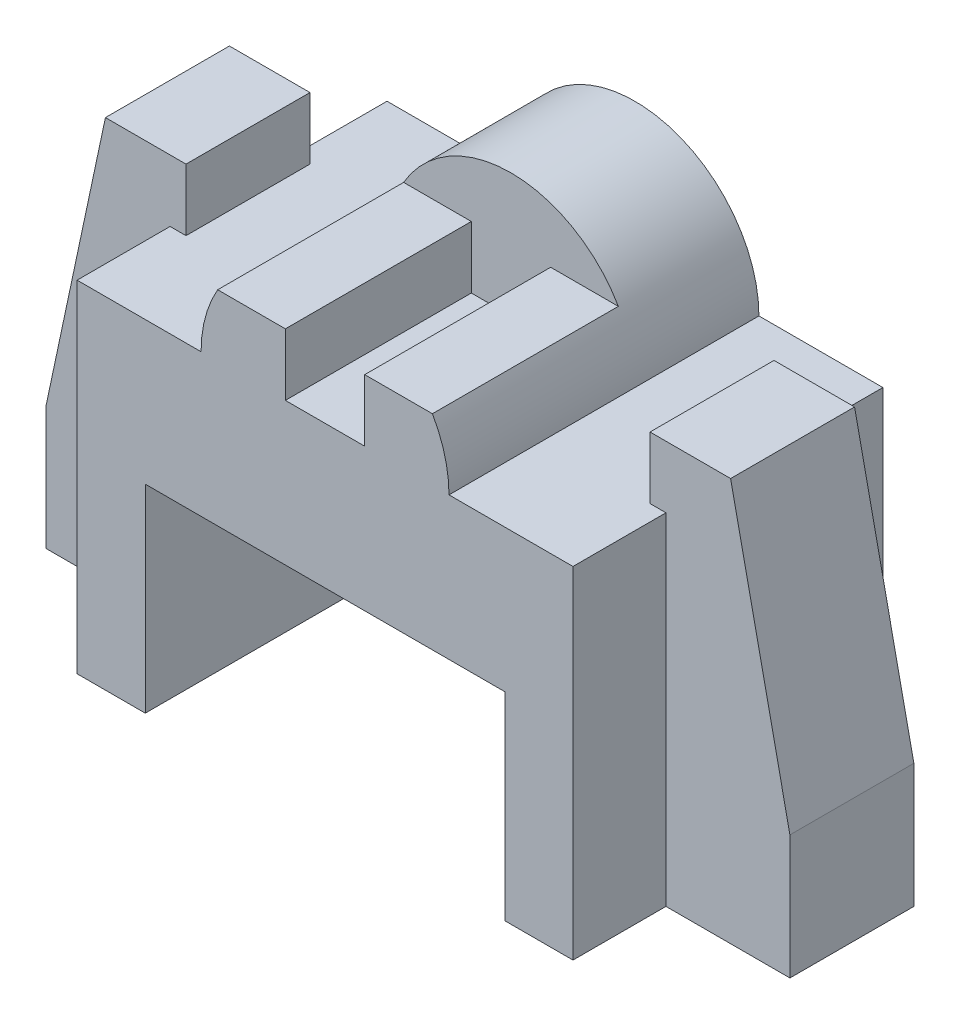
ISO-10303-21;
HEADER;
FILE_DESCRIPTION(('STEP AP214'),'2;1');
FILE_NAME('part.step','',(''),(''),'','','');
FILE_SCHEMA(('AUTOMOTIVE_DESIGN { 1 0 10303 214 1 1 1 1 }'));
ENDSEC;
DATA;
#1=APPLICATION_CONTEXT('core data for automotive mechanical design processes');
#2=APPLICATION_PROTOCOL_DEFINITION('international standard','automotive_design',2000,#1);
#3=PRODUCT_CONTEXT('',#1,'mechanical');
#4=PRODUCT('Part','Part','',(#3));
#5=PRODUCT_RELATED_PRODUCT_CATEGORY('part','',(#4));
#6=PRODUCT_DEFINITION_FORMATION('','',#4);
#7=PRODUCT_DEFINITION_CONTEXT('part definition',#1,'design');
#8=PRODUCT_DEFINITION('design','',#6,#7);
#9=PRODUCT_DEFINITION_SHAPE('','',#8);
#10=(LENGTH_UNIT() NAMED_UNIT(*) SI_UNIT(.MILLI.,.METRE.));
#11=(NAMED_UNIT(*) PLANE_ANGLE_UNIT() SI_UNIT($,.RADIAN.));
#12=(NAMED_UNIT(*) SI_UNIT($,.STERADIAN.) SOLID_ANGLE_UNIT());
#13=UNCERTAINTY_MEASURE_WITH_UNIT(LENGTH_MEASURE(1.E-05),#10,'distance_accuracy_value','');
#14=(GEOMETRIC_REPRESENTATION_CONTEXT(3) GLOBAL_UNCERTAINTY_ASSIGNED_CONTEXT((#13)) GLOBAL_UNIT_ASSIGNED_CONTEXT((#10,
#11,#12)) REPRESENTATION_CONTEXT('',''));
#15=CARTESIAN_POINT('',(0.,0.,0.));
#16=DIRECTION('',(0.,0.,1.));
#17=DIRECTION('',(1.,0.,0.));
#18=AXIS2_PLACEMENT_3D('',#15,#16,#17);
#19=CARTESIAN_POINT('',(0.,55.,-50.));
#20=DIRECTION('',(0.,-1.,0.));
#21=DIRECTION('',(0.,0.,-1.));
#22=AXIS2_PLACEMENT_3D('',#19,#20,#21);
#23=PLANE('',#22);
#24=DIRECTION('',(0.,0.,1.));
#25=VECTOR('',#24,1.);
#26=CARTESIAN_POINT('',(60.,55.,-50.));
#27=LINE('',#26,#25);
#28=CARTESIAN_POINT('',(60.,55.,-50.));
#29=VERTEX_POINT('',#28);
#30=CARTESIAN_POINT('',(60.,55.,0.));
#31=VERTEX_POINT('',#30);
#32=EDGE_CURVE('E53',#29,#31,#27,.T.);
#33=ORIENTED_EDGE('',*,*,#32,.T.);
#34=DIRECTION('',(1.,0.,0.));
#35=VECTOR('',#34,1.);
#36=CARTESIAN_POINT('',(0.,55.,0.));
#37=LINE('',#36,#35);
#38=CARTESIAN_POINT('',(80.,55.,0.));
#39=VERTEX_POINT('',#38);
#40=EDGE_CURVE('E427',#31,#39,#37,.T.);
#41=ORIENTED_EDGE('',*,*,#40,.T.);
#42=DIRECTION('',(0.,0.,1.));
#43=VECTOR('',#42,1.);
#44=CARTESIAN_POINT('',(80.,55.,-15.));
#45=LINE('',#44,#43);
#46=CARTESIAN_POINT('',(80.,55.,-15.));
#47=VERTEX_POINT('',#46);
#48=EDGE_CURVE('E430',#47,#39,#45,.T.);
#49=ORIENTED_EDGE('',*,*,#48,.F.);
#50=DIRECTION('',(1.,0.,0.));
#51=VECTOR('',#50,1.);
#52=CARTESIAN_POINT('',(77.43,55.,-15.));
#53=LINE('',#52,#51);
#54=CARTESIAN_POINT('',(77.43,55.,-15.));
#55=VERTEX_POINT('',#54);
#56=EDGE_CURVE('E446',#55,#47,#53,.T.);
#57=ORIENTED_EDGE('',*,*,#56,.F.);
#58=DIRECTION('',(0.,0.,-1.));
#59=VECTOR('',#58,1.);
#60=CARTESIAN_POINT('',(77.43,55.,1.2E-05));
#61=LINE('',#60,#59);
#62=CARTESIAN_POINT('',(77.43,55.,-35.));
#63=VERTEX_POINT('',#62);
#64=EDGE_CURVE('E40',#55,#63,#61,.T.);
#65=ORIENTED_EDGE('',*,*,#64,.T.);
#66=DIRECTION('',(1.,0.,0.));
#67=VECTOR('',#66,1.);
#68=CARTESIAN_POINT('',(80.,55.,-35.));
#69=LINE('',#68,#67);
#70=CARTESIAN_POINT('',(80.,55.,-35.));
#71=VERTEX_POINT('',#70);
#72=EDGE_CURVE('E324',#63,#71,#69,.T.);
#73=ORIENTED_EDGE('',*,*,#72,.T.);
#74=DIRECTION('',(0.,0.,1.));
#75=VECTOR('',#74,1.);
#76=CARTESIAN_POINT('',(80.,55.,-50.));
#77=LINE('',#76,#75);
#78=CARTESIAN_POINT('',(80.,55.,-50.));
#79=VERTEX_POINT('',#78);
#80=EDGE_CURVE('E315',#79,#71,#77,.T.);
#81=ORIENTED_EDGE('',*,*,#80,.F.);
#82=DIRECTION('',(1.,0.,0.));
#83=VECTOR('',#82,1.);
#84=CARTESIAN_POINT('',(0.,55.,-50.));
#85=LINE('',#84,#83);
#86=EDGE_CURVE('E357',#29,#79,#85,.T.);
#87=ORIENTED_EDGE('',*,*,#86,.F.);
#88=EDGE_LOOP('',(#33,#41,#49,#57,#65,#73,#81,#87));
#89=FACE_BOUND('',#88,.T.);
#90=ADVANCED_FACE('F36',(#89),#23,.F.);
#91=CARTESIAN_POINT('',(0.,55.,0.));
#92=VERTEX_POINT('',#91);
#93=CARTESIAN_POINT('',(20.,55.,0.));
#94=VERTEX_POINT('',#93);
#95=EDGE_CURVE('E319',#92,#94,#37,.T.);
#96=ORIENTED_EDGE('',*,*,#95,.T.);
#97=DIRECTION('',(0.,0.,1.));
#98=VECTOR('',#97,1.);
#99=CARTESIAN_POINT('',(20.,55.,-50.));
#100=LINE('',#99,#98);
#101=CARTESIAN_POINT('',(20.,55.,-50.));
#102=VERTEX_POINT('',#101);
#103=EDGE_CURVE('E295',#94,#102,#100,.F.);
#104=ORIENTED_EDGE('',*,*,#103,.T.);
#105=CARTESIAN_POINT('',(0.,55.,-50.));
#106=VERTEX_POINT('',#105);
#107=EDGE_CURVE('E352',#106,#102,#85,.T.);
#108=ORIENTED_EDGE('',*,*,#107,.F.);
#109=DIRECTION('',(0.,0.,1.));
#110=VECTOR('',#109,1.);
#111=CARTESIAN_POINT('',(0.,55.,-50.));
#112=LINE('',#111,#110);
#113=CARTESIAN_POINT('',(0.,55.,-35.));
#114=VERTEX_POINT('',#113);
#115=EDGE_CURVE('E320',#106,#114,#112,.T.);
#116=ORIENTED_EDGE('',*,*,#115,.T.);
#117=DIRECTION('',(1.,0.,0.));
#118=VECTOR('',#117,1.);
#119=CARTESIAN_POINT('',(0.,55.,-35.));
#120=LINE('',#119,#118);
#121=CARTESIAN_POINT('',(2.57,55.,-35.));
#122=VERTEX_POINT('',#121);
#123=EDGE_CURVE('E323',#114,#122,#120,.T.);
#124=ORIENTED_EDGE('',*,*,#123,.T.);
#125=DIRECTION('',(0.,0.,-1.));
#126=VECTOR('',#125,1.);
#127=CARTESIAN_POINT('',(2.57,55.,1.2E-05));
#128=LINE('',#127,#126);
#129=CARTESIAN_POINT('',(2.57,55.,-14.999988));
#130=VERTEX_POINT('',#129);
#131=EDGE_CURVE('E298',#130,#122,#128,.T.);
#132=ORIENTED_EDGE('',*,*,#131,.F.);
#133=DIRECTION('',(1.,0.,0.));
#134=VECTOR('',#133,1.);
#135=CARTESIAN_POINT('',(0.,55.,-14.999988));
#136=LINE('',#135,#134);
#137=CARTESIAN_POINT('',(0.,55.,-14.999988));
#138=VERTEX_POINT('',#137);
#139=EDGE_CURVE('E437',#138,#130,#136,.T.);
#140=ORIENTED_EDGE('',*,*,#139,.F.);
#141=DIRECTION('',(0.,0.,1.));
#142=VECTOR('',#141,1.);
#143=CARTESIAN_POINT('',(0.,55.,-14.999988));
#144=LINE('',#143,#142);
#145=EDGE_CURVE('E399',#138,#92,#144,.T.);
#146=ORIENTED_EDGE('',*,*,#145,.T.);
#147=EDGE_LOOP('',(#96,#104,#108,#116,#124,#132,#140,#146));
#148=FACE_BOUND('',#147,.T.);
#149=ADVANCED_FACE('F553',(#148),#23,.F.);
#150=CARTESIAN_POINT('',(40.,55.,-50.));
#151=DIRECTION('',(0.,0.,1.));
#152=DIRECTION('',(1.,0.,0.));
#153=AXIS2_PLACEMENT_3D('',#150,#151,#152);
#154=CYLINDRICAL_SURFACE('',#153,20.);
#155=ORIENTED_EDGE('',*,*,#103,.F.);
#156=CARTESIAN_POINT('',(40.,55.,0.));
#157=DIRECTION('',(0.,0.,1.));
#158=DIRECTION('',(1.,0.,0.));
#159=AXIS2_PLACEMENT_3D('',#156,#157,#158);
#160=CIRCLE('',#159,20.);
#161=CARTESIAN_POINT('',(22.6794919243112,65.,0.));
#162=VERTEX_POINT('',#161);
#163=EDGE_CURVE('E266',#162,#94,#160,.T.);
#164=ORIENTED_EDGE('',*,*,#163,.F.);
#165=DIRECTION('',(0.,0.,1.));
#166=VECTOR('',#165,1.);
#167=CARTESIAN_POINT('',(22.6794919243112,65.,-30.));
#168=LINE('',#167,#166);
#169=CARTESIAN_POINT('',(22.6794919243112,65.,-30.));
#170=VERTEX_POINT('',#169);
#171=EDGE_CURVE('E284',#170,#162,#168,.T.);
#172=ORIENTED_EDGE('',*,*,#171,.F.);
#173=CARTESIAN_POINT('',(40.,55.,-30.));
#174=DIRECTION('',(0.,0.,1.));
#175=DIRECTION('',(1.,0.,0.));
#176=AXIS2_PLACEMENT_3D('',#173,#174,#175);
#177=CIRCLE('',#176,20.);
#178=CARTESIAN_POINT('',(57.3205080756888,65.,-30.));
#179=VERTEX_POINT('',#178);
#180=EDGE_CURVE('E286',#179,#170,#177,.T.);
#181=ORIENTED_EDGE('',*,*,#180,.F.);
#182=DIRECTION('',(0.,0.,1.));
#183=VECTOR('',#182,1.);
#184=CARTESIAN_POINT('',(57.3205080756888,65.,-30.));
#185=LINE('',#184,#183);
#186=CARTESIAN_POINT('',(57.3205080756888,65.,0.));
#187=VERTEX_POINT('',#186);
#188=EDGE_CURVE('E244',#179,#187,#185,.T.);
#189=ORIENTED_EDGE('',*,*,#188,.T.);
#190=CARTESIAN_POINT('',(40.,55.,0.));
#191=DIRECTION('',(0.,0.,1.));
#192=DIRECTION('',(1.,0.,0.));
#193=AXIS2_PLACEMENT_3D('',#190,#191,#192);
#194=CIRCLE('',#193,20.);
#195=EDGE_CURVE('E262',#31,#187,#194,.T.);
#196=ORIENTED_EDGE('',*,*,#195,.F.);
#197=ORIENTED_EDGE('',*,*,#32,.F.);
#198=CARTESIAN_POINT('',(40.,55.,-50.));
#199=DIRECTION('',(0.,0.,1.));
#200=DIRECTION('',(1.,0.,0.));
#201=AXIS2_PLACEMENT_3D('',#198,#199,#200);
#202=CIRCLE('',#201,20.);
#203=EDGE_CURVE('E292',#29,#102,#202,.T.);
#204=ORIENTED_EDGE('',*,*,#203,.T.);
#205=EDGE_LOOP('',(#155,#164,#172,#181,#189,#196,#197,#204));
#206=FACE_BOUND('',#205,.T.);
#207=ADVANCED_FACE('F535',(#206),#154,.T.);
#208=CARTESIAN_POINT('',(2.57,55.,1.2E-05));
#209=DIRECTION('',(-1.,0.,0.));
#210=DIRECTION('',(0.,0.,1.));
#211=AXIS2_PLACEMENT_3D('',#208,#209,#210);
#212=PLANE('',#211);
#213=DIRECTION('',(0.,1.,0.));
#214=VECTOR('',#213,1.);
#215=CARTESIAN_POINT('',(2.57,55.,-14.999988));
#216=LINE('',#215,#214);
#217=CARTESIAN_POINT('',(2.57,65.,-14.999988));
#218=VERTEX_POINT('',#217);
#219=EDGE_CURVE('E435',#130,#218,#216,.T.);
#220=ORIENTED_EDGE('',*,*,#219,.F.);
#221=ORIENTED_EDGE('',*,*,#131,.T.);
#222=DIRECTION('',(0.,1.,0.));
#223=VECTOR('',#222,1.);
#224=CARTESIAN_POINT('',(2.57,55.,-35.));
#225=LINE('',#224,#223);
#226=CARTESIAN_POINT('',(2.57,65.,-35.));
#227=VERTEX_POINT('',#226);
#228=EDGE_CURVE('E380',#122,#227,#225,.T.);
#229=ORIENTED_EDGE('',*,*,#228,.T.);
#230=DIRECTION('',(0.,0.,-1.));
#231=VECTOR('',#230,1.);
#232=CARTESIAN_POINT('',(2.57,65.,1.2E-05));
#233=LINE('',#232,#231);
#234=EDGE_CURVE('E381',#218,#227,#233,.T.);
#235=ORIENTED_EDGE('',*,*,#234,.F.);
#236=EDGE_LOOP('',(#220,#221,#229,#235));
#237=FACE_BOUND('',#236,.T.);
#238=ADVANCED_FACE('F568',(#237),#212,.F.);
#239=CARTESIAN_POINT('',(2.57,65.,1.2E-05));
#240=DIRECTION('',(0.,-1.,0.));
#241=DIRECTION('',(0.,0.,-1.));
#242=AXIS2_PLACEMENT_3D('',#239,#240,#241);
#243=PLANE('',#242);
#244=DIRECTION('',(-1.,0.,0.));
#245=VECTOR('',#244,1.);
#246=CARTESIAN_POINT('',(2.57,65.,-14.999988));
#247=LINE('',#246,#245);
#248=CARTESIAN_POINT('',(-10.43,65.,-14.999988));
#249=VERTEX_POINT('',#248);
#250=EDGE_CURVE('E433',#218,#249,#247,.T.);
#251=ORIENTED_EDGE('',*,*,#250,.F.);
#252=ORIENTED_EDGE('',*,*,#234,.T.);
#253=DIRECTION('',(-1.,0.,0.));
#254=VECTOR('',#253,1.);
#255=CARTESIAN_POINT('',(2.57,65.,-35.));
#256=LINE('',#255,#254);
#257=CARTESIAN_POINT('',(-10.43,65.,-35.));
#258=VERTEX_POINT('',#257);
#259=EDGE_CURVE('E383',#227,#258,#256,.T.);
#260=ORIENTED_EDGE('',*,*,#259,.T.);
#261=DIRECTION('',(0.,0.,-1.));
#262=VECTOR('',#261,1.);
#263=CARTESIAN_POINT('',(-10.43,65.,1.2E-05));
#264=LINE('',#263,#262);
#265=EDGE_CURVE('E384',#249,#258,#264,.T.);
#266=ORIENTED_EDGE('',*,*,#265,.F.);
#267=EDGE_LOOP('',(#251,#252,#260,#266));
#268=FACE_BOUND('',#267,.T.);
#269=ADVANCED_FACE('F593',(#268),#243,.F.);
#270=CARTESIAN_POINT('',(-10.43,65.,1.2E-05));
#271=DIRECTION('',(0.978125693244708,-0.208014730763375,0.));
#272=DIRECTION('',(0.208014730763375,0.978125693244708,0.));
#273=AXIS2_PLACEMENT_3D('',#270,#271,#272);
#274=PLANE('',#273);
#275=DIRECTION('',(-0.208014730763375,-0.978125693244708,0.));
#276=VECTOR('',#275,1.);
#277=CARTESIAN_POINT('',(-10.43,65.,-14.999988));
#278=LINE('',#277,#276);
#279=CARTESIAN_POINT('',(-20.,20.,-14.999988));
#280=VERTEX_POINT('',#279);
#281=EDGE_CURVE('E431',#249,#280,#278,.T.);
#282=ORIENTED_EDGE('',*,*,#281,.F.);
#283=ORIENTED_EDGE('',*,*,#265,.T.);
#284=DIRECTION('',(-0.208014730763375,-0.978125693244708,0.));
#285=VECTOR('',#284,1.);
#286=CARTESIAN_POINT('',(-10.43,65.,-35.));
#287=LINE('',#286,#285);
#288=CARTESIAN_POINT('',(-20.,20.,-35.));
#289=VERTEX_POINT('',#288);
#290=EDGE_CURVE('E378',#258,#289,#287,.T.);
#291=ORIENTED_EDGE('',*,*,#290,.T.);
#292=DIRECTION('',(0.,0.,1.));
#293=VECTOR('',#292,1.);
#294=CARTESIAN_POINT('',(-20.,20.,-35.));
#295=LINE('',#294,#293);
#296=EDGE_CURVE('E374',#289,#280,#295,.T.);
#297=ORIENTED_EDGE('',*,*,#296,.T.);
#298=EDGE_LOOP('',(#282,#283,#291,#297));
#299=FACE_BOUND('',#298,.T.);
#300=ADVANCED_FACE('F559',(#299),#274,.F.);
#301=CARTESIAN_POINT('',(-20.,0.,1.2E-05));
#302=DIRECTION('',(1.,0.,0.));
#303=DIRECTION('',(0.,0.,-1.));
#304=AXIS2_PLACEMENT_3D('',#301,#302,#303);
#305=PLANE('',#304);
#306=DIRECTION('',(0.,-1.,0.));
#307=VECTOR('',#306,1.);
#308=CARTESIAN_POINT('',(-20.,20.,-14.999988));
#309=LINE('',#308,#307);
#310=CARTESIAN_POINT('',(-20.,0.,-14.999988));
#311=VERTEX_POINT('',#310);
#312=EDGE_CURVE('E428',#280,#311,#309,.T.);
#313=ORIENTED_EDGE('',*,*,#312,.F.);
#314=ORIENTED_EDGE('',*,*,#296,.F.);
#315=DIRECTION('',(0.,-1.,0.));
#316=VECTOR('',#315,1.);
#317=CARTESIAN_POINT('',(-20.,0.,-35.));
#318=LINE('',#317,#316);
#319=CARTESIAN_POINT('',(-20.,0.,-35.));
#320=VERTEX_POINT('',#319);
#321=EDGE_CURVE('E377',#289,#320,#318,.T.);
#322=ORIENTED_EDGE('',*,*,#321,.T.);
#323=DIRECTION('',(0.,0.,-1.));
#324=VECTOR('',#323,1.);
#325=CARTESIAN_POINT('',(-20.,0.,1.2E-05));
#326=LINE('',#325,#324);
#327=EDGE_CURVE('E301',#311,#320,#326,.T.);
#328=ORIENTED_EDGE('',*,*,#327,.F.);
#329=EDGE_LOOP('',(#313,#314,#322,#328));
#330=FACE_BOUND('',#329,.T.);
#331=ADVANCED_FACE('F551',(#330),#305,.F.);
#332=CARTESIAN_POINT('',(33.6,55.,0.));
#333=VERTEX_POINT('',#332);
#334=CARTESIAN_POINT('',(46.4,55.,0.));
#335=VERTEX_POINT('',#334);
#336=EDGE_CURVE('E61',#333,#335,#37,.T.);
#337=ORIENTED_EDGE('',*,*,#336,.T.);
#338=DIRECTION('',(0.,0.,1.));
#339=VECTOR('',#338,1.);
#340=CARTESIAN_POINT('',(46.4,55.,-30.));
#341=LINE('',#340,#339);
#342=CARTESIAN_POINT('',(46.4,55.,-30.));
#343=VERTEX_POINT('',#342);
#344=EDGE_CURVE('E254',#343,#335,#341,.T.);
#345=ORIENTED_EDGE('',*,*,#344,.F.);
#346=DIRECTION('',(1.,0.,0.));
#347=VECTOR('',#346,1.);
#348=CARTESIAN_POINT('',(20.,55.,-30.));
#349=LINE('',#348,#347);
#350=CARTESIAN_POINT('',(33.6,55.,-30.));
#351=VERTEX_POINT('',#350);
#352=EDGE_CURVE('E242',#351,#343,#349,.T.);
#353=ORIENTED_EDGE('',*,*,#352,.F.);
#354=DIRECTION('',(0.,0.,1.));
#355=VECTOR('',#354,1.);
#356=CARTESIAN_POINT('',(33.6,55.,-30.));
#357=LINE('',#356,#355);
#358=EDGE_CURVE('E276',#351,#333,#357,.T.);
#359=ORIENTED_EDGE('',*,*,#358,.T.);
#360=EDGE_LOOP('',(#337,#345,#353,#359));
#361=FACE_BOUND('',#360,.T.);
#362=ADVANCED_FACE('F549',(#361),#23,.F.);
#363=CARTESIAN_POINT('',(80.,0.,-50.));
#364=DIRECTION('',(1.,0.,0.));
#365=DIRECTION('',(0.,0.,-1.));
#366=AXIS2_PLACEMENT_3D('',#363,#364,#365);
#367=PLANE('',#366);
#368=ORIENTED_EDGE('',*,*,#80,.T.);
#369=DIRECTION('',(0.,-1.,0.));
#370=VECTOR('',#369,1.);
#371=CARTESIAN_POINT('',(80.,0.,-35.));
#372=LINE('',#371,#370);
#373=CARTESIAN_POINT('',(80.,0.,-35.));
#374=VERTEX_POINT('',#373);
#375=EDGE_CURVE('E318',#71,#374,#372,.T.);
#376=ORIENTED_EDGE('',*,*,#375,.T.);
#377=DIRECTION('',(0.,0.,1.));
#378=VECTOR('',#377,1.);
#379=CARTESIAN_POINT('',(80.,0.,-50.));
#380=LINE('',#379,#378);
#381=CARTESIAN_POINT('',(80.,0.,-50.));
#382=VERTEX_POINT('',#381);
#383=EDGE_CURVE('E310',#382,#374,#380,.T.);
#384=ORIENTED_EDGE('',*,*,#383,.F.);
#385=DIRECTION('',(0.,1.,0.));
#386=VECTOR('',#385,1.);
#387=CARTESIAN_POINT('',(80.,0.,-50.));
#388=LINE('',#387,#386);
#389=EDGE_CURVE('E360',#382,#79,#388,.T.);
#390=ORIENTED_EDGE('',*,*,#389,.T.);
#391=EDGE_LOOP('',(#368,#376,#384,#390));
#392=FACE_BOUND('',#391,.T.);
#393=ADVANCED_FACE('F494',(#392),#367,.T.);
#394=CARTESIAN_POINT('',(11.,0.,-50.));
#395=DIRECTION('',(1.,0.,0.));
#396=DIRECTION('',(0.,0.,-1.));
#397=AXIS2_PLACEMENT_3D('',#394,#395,#396);
#398=PLANE('',#397);
#399=DIRECTION('',(0.,1.,0.));
#400=VECTOR('',#399,1.);
#401=CARTESIAN_POINT('',(11.,0.,0.));
#402=LINE('',#401,#400);
#403=CARTESIAN_POINT('',(11.,0.,0.));
#404=VERTEX_POINT('',#403);
#405=CARTESIAN_POINT('',(11.,32.,0.));
#406=VERTEX_POINT('',#405);
#407=EDGE_CURVE('E349',#404,#406,#402,.T.);
#408=ORIENTED_EDGE('',*,*,#407,.F.);
#409=DIRECTION('',(0.,0.,1.));
#410=VECTOR('',#409,1.);
#411=CARTESIAN_POINT('',(11.,0.,-50.));
#412=LINE('',#411,#410);
#413=CARTESIAN_POINT('',(11.,0.,-50.));
#414=VERTEX_POINT('',#413);
#415=EDGE_CURVE('E328',#414,#404,#412,.T.);
#416=ORIENTED_EDGE('',*,*,#415,.F.);
#417=DIRECTION('',(0.,1.,0.));
#418=VECTOR('',#417,1.);
#419=CARTESIAN_POINT('',(11.,0.,-50.));
#420=LINE('',#419,#418);
#421=CARTESIAN_POINT('',(11.,32.,-50.));
#422=VERTEX_POINT('',#421);
#423=EDGE_CURVE('E302',#414,#422,#420,.T.);
#424=ORIENTED_EDGE('',*,*,#423,.T.);
#425=DIRECTION('',(0.,0.,1.));
#426=VECTOR('',#425,1.);
#427=CARTESIAN_POINT('',(11.,32.,-50.));
#428=LINE('',#427,#426);
#429=EDGE_CURVE('E299',#422,#406,#428,.T.);
#430=ORIENTED_EDGE('',*,*,#429,.T.);
#431=EDGE_LOOP('',(#408,#416,#424,#430));
#432=FACE_BOUND('',#431,.T.);
#433=ADVANCED_FACE('F519',(#432),#398,.T.);
#434=CARTESIAN_POINT('',(0.,0.,-50.));
#435=DIRECTION('',(0.,-1.,0.));
#436=DIRECTION('',(0.,0.,-1.));
#437=AXIS2_PLACEMENT_3D('',#434,#435,#436);
#438=PLANE('',#437);
#439=DIRECTION('',(0.,0.,1.));
#440=VECTOR('',#439,1.);
#441=CARTESIAN_POINT('',(0.,0.,-14.999988));
#442=LINE('',#441,#440);
#443=CARTESIAN_POINT('',(0.,0.,-14.999988));
#444=VERTEX_POINT('',#443);
#445=CARTESIAN_POINT('',(0.,0.,0.));
#446=VERTEX_POINT('',#445);
#447=EDGE_CURVE('E339',#444,#446,#442,.T.);
#448=ORIENTED_EDGE('',*,*,#447,.F.);
#449=DIRECTION('',(1.,0.,0.));
#450=VECTOR('',#449,1.);
#451=CARTESIAN_POINT('',(-20.,0.,-14.999988));
#452=LINE('',#451,#450);
#453=EDGE_CURVE('E338',#311,#444,#452,.T.);
#454=ORIENTED_EDGE('',*,*,#453,.F.);
#455=ORIENTED_EDGE('',*,*,#327,.T.);
#456=DIRECTION('',(1.,0.,0.));
#457=VECTOR('',#456,1.);
#458=CARTESIAN_POINT('',(0.,0.,-35.));
#459=LINE('',#458,#457);
#460=CARTESIAN_POINT('',(0.,0.,-35.));
#461=VERTEX_POINT('',#460);
#462=EDGE_CURVE('E355',#320,#461,#459,.T.);
#463=ORIENTED_EDGE('',*,*,#462,.T.);
#464=DIRECTION('',(0.,0.,1.));
#465=VECTOR('',#464,1.);
#466=CARTESIAN_POINT('',(0.,0.,-50.));
#467=LINE('',#466,#465);
#468=CARTESIAN_POINT('',(0.,0.,-50.));
#469=VERTEX_POINT('',#468);
#470=EDGE_CURVE('E325',#469,#461,#467,.T.);
#471=ORIENTED_EDGE('',*,*,#470,.F.);
#472=DIRECTION('',(1.,0.,0.));
#473=VECTOR('',#472,1.);
#474=CARTESIAN_POINT('',(0.,0.,-50.));
#475=LINE('',#474,#473);
#476=EDGE_CURVE('E330',#469,#414,#475,.T.);
#477=ORIENTED_EDGE('',*,*,#476,.T.);
#478=ORIENTED_EDGE('',*,*,#415,.T.);
#479=DIRECTION('',(1.,0.,0.));
#480=VECTOR('',#479,1.);
#481=CARTESIAN_POINT('',(0.,0.,0.));
#482=LINE('',#481,#480);
#483=EDGE_CURVE('E331',#446,#404,#482,.T.);
#484=ORIENTED_EDGE('',*,*,#483,.F.);
#485=EDGE_LOOP('',(#448,#454,#455,#463,#471,#477,#478,#484));
#486=FACE_BOUND('',#485,.T.);
#487=ADVANCED_FACE('F523',(#486),#438,.T.);
#488=CARTESIAN_POINT('',(0.,0.,-50.));
#489=DIRECTION('',(1.,0.,0.));
#490=DIRECTION('',(0.,0.,-1.));
#491=AXIS2_PLACEMENT_3D('',#488,#489,#490);
#492=PLANE('',#491);
#493=ORIENTED_EDGE('',*,*,#470,.T.);
#494=DIRECTION('',(0.,1.,0.));
#495=VECTOR('',#494,1.);
#496=CARTESIAN_POINT('',(0.,0.,-35.));
#497=LINE('',#496,#495);
#498=EDGE_CURVE('E327',#461,#114,#497,.T.);
#499=ORIENTED_EDGE('',*,*,#498,.T.);
#500=ORIENTED_EDGE('',*,*,#115,.F.);
#501=DIRECTION('',(0.,1.,0.));
#502=VECTOR('',#501,1.);
#503=CARTESIAN_POINT('',(0.,0.,-50.));
#504=LINE('',#503,#502);
#505=EDGE_CURVE('E305',#469,#106,#504,.T.);
#506=ORIENTED_EDGE('',*,*,#505,.F.);
#507=EDGE_LOOP('',(#493,#499,#500,#506));
#508=FACE_BOUND('',#507,.T.);
#509=ADVANCED_FACE('F530',(#508),#492,.F.);
#510=CARTESIAN_POINT('',(69.,0.,-50.));
#511=DIRECTION('',(0.,-1.,0.));
#512=DIRECTION('',(0.,0.,-1.));
#513=AXIS2_PLACEMENT_3D('',#510,#511,#512);
#514=PLANE('',#513);
#515=DIRECTION('',(1.,0.,0.));
#516=VECTOR('',#515,1.);
#517=CARTESIAN_POINT('',(80.,0.,-15.));
#518=LINE('',#517,#516);
#519=CARTESIAN_POINT('',(80.,0.,-15.));
#520=VERTEX_POINT('',#519);
#521=CARTESIAN_POINT('',(100.,0.,-15.));
#522=VERTEX_POINT('',#521);
#523=EDGE_CURVE('E454',#520,#522,#518,.T.);
#524=ORIENTED_EDGE('',*,*,#523,.F.);
#525=DIRECTION('',(0.,0.,1.));
#526=VECTOR('',#525,1.);
#527=CARTESIAN_POINT('',(80.,0.,-15.));
#528=LINE('',#527,#526);
#529=CARTESIAN_POINT('',(80.,0.,0.));
#530=VERTEX_POINT('',#529);
#531=EDGE_CURVE('E365',#520,#530,#528,.T.);
#532=ORIENTED_EDGE('',*,*,#531,.T.);
#533=DIRECTION('',(1.,0.,0.));
#534=VECTOR('',#533,1.);
#535=CARTESIAN_POINT('',(69.,0.,0.));
#536=LINE('',#535,#534);
#537=CARTESIAN_POINT('',(69.,0.,0.));
#538=VERTEX_POINT('',#537);
#539=EDGE_CURVE('E340',#538,#530,#536,.T.);
#540=ORIENTED_EDGE('',*,*,#539,.F.);
#541=DIRECTION('',(0.,0.,1.));
#542=VECTOR('',#541,1.);
#543=CARTESIAN_POINT('',(69.,0.,-50.));
#544=LINE('',#543,#542);
#545=CARTESIAN_POINT('',(69.,0.,-50.));
#546=VERTEX_POINT('',#545);
#547=EDGE_CURVE('E307',#546,#538,#544,.T.);
#548=ORIENTED_EDGE('',*,*,#547,.F.);
#549=DIRECTION('',(1.,0.,0.));
#550=VECTOR('',#549,1.);
#551=CARTESIAN_POINT('',(69.,0.,-50.));
#552=LINE('',#551,#550);
#553=EDGE_CURVE('E314',#546,#382,#552,.T.);
#554=ORIENTED_EDGE('',*,*,#553,.T.);
#555=ORIENTED_EDGE('',*,*,#383,.T.);
#556=DIRECTION('',(1.,0.,0.));
#557=VECTOR('',#556,1.);
#558=CARTESIAN_POINT('',(80.,0.,-35.));
#559=LINE('',#558,#557);
#560=CARTESIAN_POINT('',(100.,0.,-35.));
#561=VERTEX_POINT('',#560);
#562=EDGE_CURVE('E313',#374,#561,#559,.T.);
#563=ORIENTED_EDGE('',*,*,#562,.T.);
#564=DIRECTION('',(0.,0.,-1.));
#565=VECTOR('',#564,1.);
#566=CARTESIAN_POINT('',(100.,0.,1.2E-05));
#567=LINE('',#566,#565);
#568=EDGE_CURVE('E405',#522,#561,#567,.T.);
#569=ORIENTED_EDGE('',*,*,#568,.F.);
#570=EDGE_LOOP('',(#524,#532,#540,#548,#554,#555,#563,#569));
#571=FACE_BOUND('',#570,.T.);
#572=ADVANCED_FACE('F38',(#571),#514,.T.);
#573=CARTESIAN_POINT('',(69.,32.,-50.));
#574=DIRECTION('',(-1.,0.,0.));
#575=DIRECTION('',(0.,0.,1.));
#576=AXIS2_PLACEMENT_3D('',#573,#574,#575);
#577=PLANE('',#576);
#578=DIRECTION('',(0.,-1.,0.));
#579=VECTOR('',#578,1.);
#580=CARTESIAN_POINT('',(69.,32.,0.));
#581=LINE('',#580,#579);
#582=CARTESIAN_POINT('',(69.,32.,0.));
#583=VERTEX_POINT('',#582);
#584=EDGE_CURVE('E343',#583,#538,#581,.T.);
#585=ORIENTED_EDGE('',*,*,#584,.F.);
#586=DIRECTION('',(0.,0.,1.));
#587=VECTOR('',#586,1.);
#588=CARTESIAN_POINT('',(69.,32.,-50.));
#589=LINE('',#588,#587);
#590=CARTESIAN_POINT('',(69.,32.,-50.));
#591=VERTEX_POINT('',#590);
#592=EDGE_CURVE('E303',#591,#583,#589,.T.);
#593=ORIENTED_EDGE('',*,*,#592,.F.);
#594=DIRECTION('',(0.,-1.,0.));
#595=VECTOR('',#594,1.);
#596=CARTESIAN_POINT('',(69.,32.,-50.));
#597=LINE('',#596,#595);
#598=EDGE_CURVE('E309',#591,#546,#597,.T.);
#599=ORIENTED_EDGE('',*,*,#598,.T.);
#600=ORIENTED_EDGE('',*,*,#547,.T.);
#601=EDGE_LOOP('',(#585,#593,#599,#600));
#602=FACE_BOUND('',#601,.T.);
#603=ADVANCED_FACE('F509',(#602),#577,.T.);
#604=CARTESIAN_POINT('',(11.,32.,-50.));
#605=DIRECTION('',(0.,-1.,0.));
#606=DIRECTION('',(0.,0.,-1.));
#607=AXIS2_PLACEMENT_3D('',#604,#605,#606);
#608=PLANE('',#607);
#609=DIRECTION('',(1.,0.,0.));
#610=VECTOR('',#609,1.);
#611=CARTESIAN_POINT('',(11.,32.,0.));
#612=LINE('',#611,#610);
#613=EDGE_CURVE('E346',#406,#583,#612,.T.);
#614=ORIENTED_EDGE('',*,*,#613,.F.);
#615=ORIENTED_EDGE('',*,*,#429,.F.);
#616=DIRECTION('',(1.,0.,0.));
#617=VECTOR('',#616,1.);
#618=CARTESIAN_POINT('',(11.,32.,-50.));
#619=LINE('',#618,#617);
#620=EDGE_CURVE('E306',#422,#591,#619,.T.);
#621=ORIENTED_EDGE('',*,*,#620,.T.);
#622=ORIENTED_EDGE('',*,*,#592,.T.);
#623=EDGE_LOOP('',(#614,#615,#621,#622));
#624=FACE_BOUND('',#623,.T.);
#625=ADVANCED_FACE('F516',(#624),#608,.T.);
#626=CARTESIAN_POINT('',(0.,0.,-50.));
#627=DIRECTION('',(0.,0.,-1.));
#628=DIRECTION('',(-1.,0.,0.));
#629=AXIS2_PLACEMENT_3D('',#626,#627,#628);
#630=PLANE('',#629);
#631=ORIENTED_EDGE('',*,*,#107,.T.);
#632=ORIENTED_EDGE('',*,*,#203,.F.);
#633=ORIENTED_EDGE('',*,*,#86,.T.);
#634=ORIENTED_EDGE('',*,*,#389,.F.);
#635=ORIENTED_EDGE('',*,*,#553,.F.);
#636=ORIENTED_EDGE('',*,*,#598,.F.);
#637=ORIENTED_EDGE('',*,*,#620,.F.);
#638=ORIENTED_EDGE('',*,*,#423,.F.);
#639=ORIENTED_EDGE('',*,*,#476,.F.);
#640=ORIENTED_EDGE('',*,*,#505,.T.);
#641=EDGE_LOOP('',(#631,#632,#633,#634,#635,#636,#637,#638,#639,#640));
#642=FACE_BOUND('',#641,.T.);
#643=ADVANCED_FACE('F513',(#642),#630,.T.);
#644=CARTESIAN_POINT('',(0.,0.,0.));
#645=DIRECTION('',(0.,0.,-1.));
#646=DIRECTION('',(-1.,0.,0.));
#647=AXIS2_PLACEMENT_3D('',#644,#645,#646);
#648=PLANE('',#647);
#649=DIRECTION('',(0.,1.,0.));
#650=VECTOR('',#649,1.);
#651=CARTESIAN_POINT('',(80.,0.,0.));
#652=LINE('',#651,#650);
#653=EDGE_CURVE('E335',#530,#39,#652,.T.);
#654=ORIENTED_EDGE('',*,*,#653,.T.);
#655=ORIENTED_EDGE('',*,*,#40,.F.);
#656=ORIENTED_EDGE('',*,*,#195,.T.);
#657=DIRECTION('',(-1.,0.,0.));
#658=VECTOR('',#657,1.);
#659=CARTESIAN_POINT('',(46.4,65.,0.));
#660=LINE('',#659,#658);
#661=CARTESIAN_POINT('',(46.4,65.,0.));
#662=VERTEX_POINT('',#661);
#663=EDGE_CURVE('E259',#187,#662,#660,.T.);
#664=ORIENTED_EDGE('',*,*,#663,.T.);
#665=DIRECTION('',(0.,-1.,0.));
#666=VECTOR('',#665,1.);
#667=CARTESIAN_POINT('',(46.4,55.,0.));
#668=LINE('',#667,#666);
#669=EDGE_CURVE('E250',#662,#335,#668,.T.);
#670=ORIENTED_EDGE('',*,*,#669,.T.);
#671=ORIENTED_EDGE('',*,*,#336,.F.);
#672=DIRECTION('',(0.,1.,0.));
#673=VECTOR('',#672,1.);
#674=CARTESIAN_POINT('',(33.6,55.,0.));
#675=LINE('',#674,#673);
#676=CARTESIAN_POINT('',(33.6,65.,0.));
#677=VERTEX_POINT('',#676);
#678=EDGE_CURVE('E279',#333,#677,#675,.T.);
#679=ORIENTED_EDGE('',*,*,#678,.T.);
#680=DIRECTION('',(-1.,0.,0.));
#681=VECTOR('',#680,1.);
#682=CARTESIAN_POINT('',(33.6,65.,0.));
#683=LINE('',#682,#681);
#684=EDGE_CURVE('E273',#677,#162,#683,.T.);
#685=ORIENTED_EDGE('',*,*,#684,.T.);
#686=ORIENTED_EDGE('',*,*,#163,.T.);
#687=ORIENTED_EDGE('',*,*,#95,.F.);
#688=DIRECTION('',(0.,1.,0.));
#689=VECTOR('',#688,1.);
#690=CARTESIAN_POINT('',(0.,0.,0.));
#691=LINE('',#690,#689);
#692=EDGE_CURVE('E336',#446,#92,#691,.T.);
#693=ORIENTED_EDGE('',*,*,#692,.F.);
#694=ORIENTED_EDGE('',*,*,#483,.T.);
#695=ORIENTED_EDGE('',*,*,#407,.T.);
#696=ORIENTED_EDGE('',*,*,#613,.T.);
#697=ORIENTED_EDGE('',*,*,#584,.T.);
#698=ORIENTED_EDGE('',*,*,#539,.T.);
#699=EDGE_LOOP('',(#654,#655,#656,#664,#670,#671,#679,#685,#686,#687,#693,#694,#695,#696,#697,#698));
#700=FACE_BOUND('',#699,.T.);
#701=ADVANCED_FACE('F506',(#700),#648,.F.);
#702=CARTESIAN_POINT('',(0.,0.,-35.));
#703=DIRECTION('',(0.,0.,-1.));
#704=DIRECTION('',(-1.,0.,0.));
#705=AXIS2_PLACEMENT_3D('',#702,#703,#704);
#706=PLANE('',#705);
#707=ORIENTED_EDGE('',*,*,#498,.F.);
#708=ORIENTED_EDGE('',*,*,#462,.F.);
#709=ORIENTED_EDGE('',*,*,#321,.F.);
#710=ORIENTED_EDGE('',*,*,#290,.F.);
#711=ORIENTED_EDGE('',*,*,#259,.F.);
#712=ORIENTED_EDGE('',*,*,#228,.F.);
#713=ORIENTED_EDGE('',*,*,#123,.F.);
#714=EDGE_LOOP('',(#707,#708,#709,#710,#711,#712,#713));
#715=FACE_BOUND('',#714,.T.);
#716=ADVANCED_FACE('F581',(#715),#706,.T.);
#717=CARTESIAN_POINT('',(100.,0.,1.2E-05));
#718=DIRECTION('',(-1.,0.,0.));
#719=DIRECTION('',(0.,0.,1.));
#720=AXIS2_PLACEMENT_3D('',#717,#718,#719);
#721=PLANE('',#720);
#722=DIRECTION('',(0.,0.,1.));
#723=VECTOR('',#722,1.);
#724=CARTESIAN_POINT('',(100.,20.,-35.));
#725=LINE('',#724,#723);
#726=CARTESIAN_POINT('',(100.,20.,-35.));
#727=VERTEX_POINT('',#726);
#728=CARTESIAN_POINT('',(100.,20.,-15.));
#729=VERTEX_POINT('',#728);
#730=EDGE_CURVE('E334',#727,#729,#725,.T.);
#731=ORIENTED_EDGE('',*,*,#730,.T.);
#732=DIRECTION('',(0.,1.,0.));
#733=VECTOR('',#732,1.);
#734=CARTESIAN_POINT('',(100.,0.,-15.));
#735=LINE('',#734,#733);
#736=EDGE_CURVE('E452',#522,#729,#735,.T.);
#737=ORIENTED_EDGE('',*,*,#736,.F.);
#738=ORIENTED_EDGE('',*,*,#568,.T.);
#739=DIRECTION('',(0.,1.,0.));
#740=VECTOR('',#739,1.);
#741=CARTESIAN_POINT('',(100.,0.,-35.));
#742=LINE('',#741,#740);
#743=EDGE_CURVE('E418',#561,#727,#742,.T.);
#744=ORIENTED_EDGE('',*,*,#743,.T.);
#745=EDGE_LOOP('',(#731,#737,#738,#744));
#746=FACE_BOUND('',#745,.T.);
#747=ADVANCED_FACE('F488',(#746),#721,.F.);
#748=CARTESIAN_POINT('',(90.43,65.,1.2E-05));
#749=DIRECTION('',(-0.978125693244708,-0.208014730763374,0.));
#750=DIRECTION('',(0.208014730763374,-0.978125693244708,0.));
#751=AXIS2_PLACEMENT_3D('',#748,#749,#750);
#752=PLANE('',#751);
#753=DIRECTION('',(0.,0.,-1.));
#754=VECTOR('',#753,1.);
#755=CARTESIAN_POINT('',(90.43,65.,1.2E-05));
#756=LINE('',#755,#754);
#757=CARTESIAN_POINT('',(90.43,65.,-15.));
#758=VERTEX_POINT('',#757);
#759=CARTESIAN_POINT('',(90.43,65.,-35.));
#760=VERTEX_POINT('',#759);
#761=EDGE_CURVE('E414',#758,#760,#756,.T.);
#762=ORIENTED_EDGE('',*,*,#761,.F.);
#763=DIRECTION('',(-0.208014730763374,0.978125693244708,0.));
#764=VECTOR('',#763,1.);
#765=CARTESIAN_POINT('',(100.,20.,-15.));
#766=LINE('',#765,#764);
#767=EDGE_CURVE('E450',#729,#758,#766,.T.);
#768=ORIENTED_EDGE('',*,*,#767,.F.);
#769=ORIENTED_EDGE('',*,*,#730,.F.);
#770=DIRECTION('',(-0.208014730763374,0.978125693244708,0.));
#771=VECTOR('',#770,1.);
#772=CARTESIAN_POINT('',(90.43,65.,-35.));
#773=LINE('',#772,#771);
#774=EDGE_CURVE('E415',#727,#760,#773,.T.);
#775=ORIENTED_EDGE('',*,*,#774,.T.);
#776=EDGE_LOOP('',(#762,#768,#769,#775));
#777=FACE_BOUND('',#776,.T.);
#778=ADVANCED_FACE('F484',(#777),#752,.F.);
#779=CARTESIAN_POINT('',(77.43,65.,1.2E-05));
#780=DIRECTION('',(0.,-1.,0.));
#781=DIRECTION('',(0.,0.,-1.));
#782=AXIS2_PLACEMENT_3D('',#779,#780,#781);
#783=PLANE('',#782);
#784=DIRECTION('',(0.,0.,-1.));
#785=VECTOR('',#784,1.);
#786=CARTESIAN_POINT('',(77.43,65.,1.2E-05));
#787=LINE('',#786,#785);
#788=CARTESIAN_POINT('',(77.43,65.,-15.));
#789=VERTEX_POINT('',#788);
#790=CARTESIAN_POINT('',(77.43,65.,-35.));
#791=VERTEX_POINT('',#790);
#792=EDGE_CURVE('E410',#789,#791,#787,.T.);
#793=ORIENTED_EDGE('',*,*,#792,.F.);
#794=DIRECTION('',(-1.,0.,0.));
#795=VECTOR('',#794,1.);
#796=CARTESIAN_POINT('',(90.43,65.,-15.));
#797=LINE('',#796,#795);
#798=EDGE_CURVE('E45',#758,#789,#797,.T.);
#799=ORIENTED_EDGE('',*,*,#798,.F.);
#800=ORIENTED_EDGE('',*,*,#761,.T.);
#801=DIRECTION('',(-1.,0.,0.));
#802=VECTOR('',#801,1.);
#803=CARTESIAN_POINT('',(77.43,65.,-35.));
#804=LINE('',#803,#802);
#805=EDGE_CURVE('E411',#760,#791,#804,.T.);
#806=ORIENTED_EDGE('',*,*,#805,.T.);
#807=EDGE_LOOP('',(#793,#799,#800,#806));
#808=FACE_BOUND('',#807,.T.);
#809=ADVANCED_FACE('F480',(#808),#783,.F.);
#810=CARTESIAN_POINT('',(77.43,55.,1.2E-05));
#811=DIRECTION('',(1.,0.,0.));
#812=DIRECTION('',(0.,0.,-1.));
#813=AXIS2_PLACEMENT_3D('',#810,#811,#812);
#814=PLANE('',#813);
#815=ORIENTED_EDGE('',*,*,#64,.F.);
#816=DIRECTION('',(0.,-1.,0.));
#817=VECTOR('',#816,1.);
#818=CARTESIAN_POINT('',(77.43,65.,-15.));
#819=LINE('',#818,#817);
#820=EDGE_CURVE('E11',#789,#55,#819,.T.);
#821=ORIENTED_EDGE('',*,*,#820,.F.);
#822=ORIENTED_EDGE('',*,*,#792,.T.);
#823=DIRECTION('',(0.,-1.,0.));
#824=VECTOR('',#823,1.);
#825=CARTESIAN_POINT('',(77.43,55.,-35.));
#826=LINE('',#825,#824);
#827=EDGE_CURVE('E407',#791,#63,#826,.T.);
#828=ORIENTED_EDGE('',*,*,#827,.T.);
#829=EDGE_LOOP('',(#815,#821,#822,#828));
#830=FACE_BOUND('',#829,.T.);
#831=ADVANCED_FACE('F471',(#830),#814,.F.);
#832=CARTESIAN_POINT('',(0.,0.,-35.));
#833=DIRECTION('',(0.,0.,1.));
#834=DIRECTION('',(1.,0.,0.));
#835=AXIS2_PLACEMENT_3D('',#832,#833,#834);
#836=PLANE('',#835);
#837=ORIENTED_EDGE('',*,*,#375,.F.);
#838=ORIENTED_EDGE('',*,*,#72,.F.);
#839=ORIENTED_EDGE('',*,*,#827,.F.);
#840=ORIENTED_EDGE('',*,*,#805,.F.);
#841=ORIENTED_EDGE('',*,*,#774,.F.);
#842=ORIENTED_EDGE('',*,*,#743,.F.);
#843=ORIENTED_EDGE('',*,*,#562,.F.);
#844=EDGE_LOOP('',(#837,#838,#839,#840,#841,#842,#843));
#845=FACE_BOUND('',#844,.T.);
#846=ADVANCED_FACE('F478',(#845),#836,.F.);
#847=CARTESIAN_POINT('',(0.,0.,-14.999988));
#848=DIRECTION('',(1.,0.,0.));
#849=DIRECTION('',(0.,0.,-1.));
#850=AXIS2_PLACEMENT_3D('',#847,#848,#849);
#851=PLANE('',#850);
#852=ORIENTED_EDGE('',*,*,#145,.F.);
#853=DIRECTION('',(0.,1.,0.));
#854=VECTOR('',#853,1.);
#855=CARTESIAN_POINT('',(0.,0.,-14.999988));
#856=LINE('',#855,#854);
#857=EDGE_CURVE('E439',#444,#138,#856,.T.);
#858=ORIENTED_EDGE('',*,*,#857,.F.);
#859=ORIENTED_EDGE('',*,*,#447,.T.);
#860=ORIENTED_EDGE('',*,*,#692,.T.);
#861=EDGE_LOOP('',(#852,#858,#859,#860));
#862=FACE_BOUND('',#861,.T.);
#863=ADVANCED_FACE('F573',(#862),#851,.F.);
#864=CARTESIAN_POINT('',(0.,0.,-14.999988));
#865=DIRECTION('',(0.,0.,1.));
#866=DIRECTION('',(1.,0.,0.));
#867=AXIS2_PLACEMENT_3D('',#864,#865,#866);
#868=PLANE('',#867);
#869=ORIENTED_EDGE('',*,*,#453,.T.);
#870=ORIENTED_EDGE('',*,*,#857,.T.);
#871=ORIENTED_EDGE('',*,*,#139,.T.);
#872=ORIENTED_EDGE('',*,*,#219,.T.);
#873=ORIENTED_EDGE('',*,*,#250,.T.);
#874=ORIENTED_EDGE('',*,*,#281,.T.);
#875=ORIENTED_EDGE('',*,*,#312,.T.);
#876=EDGE_LOOP('',(#869,#870,#871,#872,#873,#874,#875));
#877=FACE_BOUND('',#876,.T.);
#878=ADVANCED_FACE('F589',(#877),#868,.T.);
#879=CARTESIAN_POINT('',(80.,55.,-15.));
#880=DIRECTION('',(-1.,0.,0.));
#881=DIRECTION('',(0.,0.,1.));
#882=AXIS2_PLACEMENT_3D('',#879,#880,#881);
#883=PLANE('',#882);
#884=ORIENTED_EDGE('',*,*,#653,.F.);
#885=ORIENTED_EDGE('',*,*,#531,.F.);
#886=DIRECTION('',(0.,-1.,0.));
#887=VECTOR('',#886,1.);
#888=CARTESIAN_POINT('',(80.,55.,-15.));
#889=LINE('',#888,#887);
#890=EDGE_CURVE('E456',#47,#520,#889,.T.);
#891=ORIENTED_EDGE('',*,*,#890,.F.);
#892=ORIENTED_EDGE('',*,*,#48,.T.);
#893=EDGE_LOOP('',(#884,#885,#891,#892));
#894=FACE_BOUND('',#893,.T.);
#895=ADVANCED_FACE('F501',(#894),#883,.F.);
#896=CARTESIAN_POINT('',(0.,0.,-15.));
#897=DIRECTION('',(0.,0.,-1.));
#898=DIRECTION('',(-1.,0.,0.));
#899=AXIS2_PLACEMENT_3D('',#896,#897,#898);
#900=PLANE('',#899);
#901=ORIENTED_EDGE('',*,*,#56,.T.);
#902=ORIENTED_EDGE('',*,*,#890,.T.);
#903=ORIENTED_EDGE('',*,*,#523,.T.);
#904=ORIENTED_EDGE('',*,*,#736,.T.);
#905=ORIENTED_EDGE('',*,*,#767,.T.);
#906=ORIENTED_EDGE('',*,*,#798,.T.);
#907=ORIENTED_EDGE('',*,*,#820,.T.);
#908=EDGE_LOOP('',(#901,#902,#903,#904,#905,#906,#907));
#909=FACE_BOUND('',#908,.T.);
#910=ADVANCED_FACE('F499',(#909),#900,.F.);
#911=CARTESIAN_POINT('',(40.,55.,-30.));
#912=DIRECTION('',(0.,0.,1.));
#913=DIRECTION('',(1.,0.,0.));
#914=AXIS2_PLACEMENT_3D('',#911,#912,#913);
#915=PLANE('',#914);
#916=DIRECTION('',(0.,-1.,0.));
#917=VECTOR('',#916,1.);
#918=CARTESIAN_POINT('',(46.4,55.,-30.));
#919=LINE('',#918,#917);
#920=CARTESIAN_POINT('',(46.4,65.,-30.));
#921=VERTEX_POINT('',#920);
#922=EDGE_CURVE('E235',#921,#343,#919,.T.);
#923=ORIENTED_EDGE('',*,*,#922,.F.);
#924=DIRECTION('',(-1.,0.,0.));
#925=VECTOR('',#924,1.);
#926=CARTESIAN_POINT('',(46.4,65.,-30.));
#927=LINE('',#926,#925);
#928=EDGE_CURVE('E239',#179,#921,#927,.T.);
#929=ORIENTED_EDGE('',*,*,#928,.F.);
#930=ORIENTED_EDGE('',*,*,#180,.T.);
#931=DIRECTION('',(-1.,0.,0.));
#932=VECTOR('',#931,1.);
#933=CARTESIAN_POINT('',(33.6,65.,-30.));
#934=LINE('',#933,#932);
#935=CARTESIAN_POINT('',(33.6,65.,-30.));
#936=VERTEX_POINT('',#935);
#937=EDGE_CURVE('E272',#936,#170,#934,.T.);
#938=ORIENTED_EDGE('',*,*,#937,.F.);
#939=DIRECTION('',(0.,1.,0.));
#940=VECTOR('',#939,1.);
#941=CARTESIAN_POINT('',(33.6,55.,-30.));
#942=LINE('',#941,#940);
#943=EDGE_CURVE('E269',#351,#936,#942,.T.);
#944=ORIENTED_EDGE('',*,*,#943,.F.);
#945=ORIENTED_EDGE('',*,*,#352,.T.);
#946=EDGE_LOOP('',(#923,#929,#930,#938,#944,#945));
#947=FACE_BOUND('',#946,.T.);
#948=ADVANCED_FACE('F237',(#947),#915,.T.);
#949=CARTESIAN_POINT('',(33.6,65.,-30.));
#950=DIRECTION('',(0.,1.,0.));
#951=DIRECTION('',(0.,0.,1.));
#952=AXIS2_PLACEMENT_3D('',#949,#950,#951);
#953=PLANE('',#952);
#954=ORIENTED_EDGE('',*,*,#684,.F.);
#955=DIRECTION('',(0.,0.,1.));
#956=VECTOR('',#955,1.);
#957=CARTESIAN_POINT('',(33.6,65.,-30.));
#958=LINE('',#957,#956);
#959=EDGE_CURVE('E287',#936,#677,#958,.T.);
#960=ORIENTED_EDGE('',*,*,#959,.F.);
#961=ORIENTED_EDGE('',*,*,#937,.T.);
#962=ORIENTED_EDGE('',*,*,#171,.T.);
#963=EDGE_LOOP('',(#954,#960,#961,#962));
#964=FACE_BOUND('',#963,.T.);
#965=ADVANCED_FACE('F545',(#964),#953,.T.);
#966=CARTESIAN_POINT('',(33.6,55.,-30.));
#967=DIRECTION('',(1.,0.,0.));
#968=DIRECTION('',(0.,0.,-1.));
#969=AXIS2_PLACEMENT_3D('',#966,#967,#968);
#970=PLANE('',#969);
#971=ORIENTED_EDGE('',*,*,#678,.F.);
#972=ORIENTED_EDGE('',*,*,#358,.F.);
#973=ORIENTED_EDGE('',*,*,#943,.T.);
#974=ORIENTED_EDGE('',*,*,#959,.T.);
#975=EDGE_LOOP('',(#971,#972,#973,#974));
#976=FACE_BOUND('',#975,.T.);
#977=ADVANCED_FACE('F542',(#976),#970,.T.);
#978=CARTESIAN_POINT('',(46.4,55.,-30.));
#979=DIRECTION('',(-1.,0.,0.));
#980=DIRECTION('',(0.,0.,1.));
#981=AXIS2_PLACEMENT_3D('',#978,#979,#980);
#982=PLANE('',#981);
#983=ORIENTED_EDGE('',*,*,#669,.F.);
#984=DIRECTION('',(0.,0.,1.));
#985=VECTOR('',#984,1.);
#986=CARTESIAN_POINT('',(46.4,65.,-30.));
#987=LINE('',#986,#985);
#988=EDGE_CURVE('E247',#921,#662,#987,.T.);
#989=ORIENTED_EDGE('',*,*,#988,.F.);
#990=ORIENTED_EDGE('',*,*,#922,.T.);
#991=ORIENTED_EDGE('',*,*,#344,.T.);
#992=EDGE_LOOP('',(#983,#989,#990,#991));
#993=FACE_BOUND('',#992,.T.);
#994=ADVANCED_FACE('F248',(#993),#982,.T.);
#995=CARTESIAN_POINT('',(46.4,65.,-30.));
#996=DIRECTION('',(0.,1.,0.));
#997=DIRECTION('',(0.,0.,1.));
#998=AXIS2_PLACEMENT_3D('',#995,#996,#997);
#999=PLANE('',#998);
#1000=ORIENTED_EDGE('',*,*,#663,.F.);
#1001=ORIENTED_EDGE('',*,*,#188,.F.);
#1002=ORIENTED_EDGE('',*,*,#928,.T.);
#1003=ORIENTED_EDGE('',*,*,#988,.T.);
#1004=EDGE_LOOP('',(#1000,#1001,#1002,#1003));
#1005=FACE_BOUND('',#1004,.T.);
#1006=ADVANCED_FACE('F257',(#1005),#999,.T.);
#1007=CLOSED_SHELL('',(#90,#149,#207,#238,#269,#300,#331,#362,#393,#433,#487,#509,#572,#603,
#625,#643,#701,#716,#747,#778,#809,#831,#846,#863,#878,#895,#910,#948,#965,#977,#994,#1006));
#1008=MANIFOLD_SOLID_BREP('B2',#1007);
#1009=ADVANCED_BREP_SHAPE_REPRESENTATION('',(#18,#1008),#14);
#1010=SHAPE_DEFINITION_REPRESENTATION(#9,#1009);
ENDSEC;
END-ISO-10303-21;
